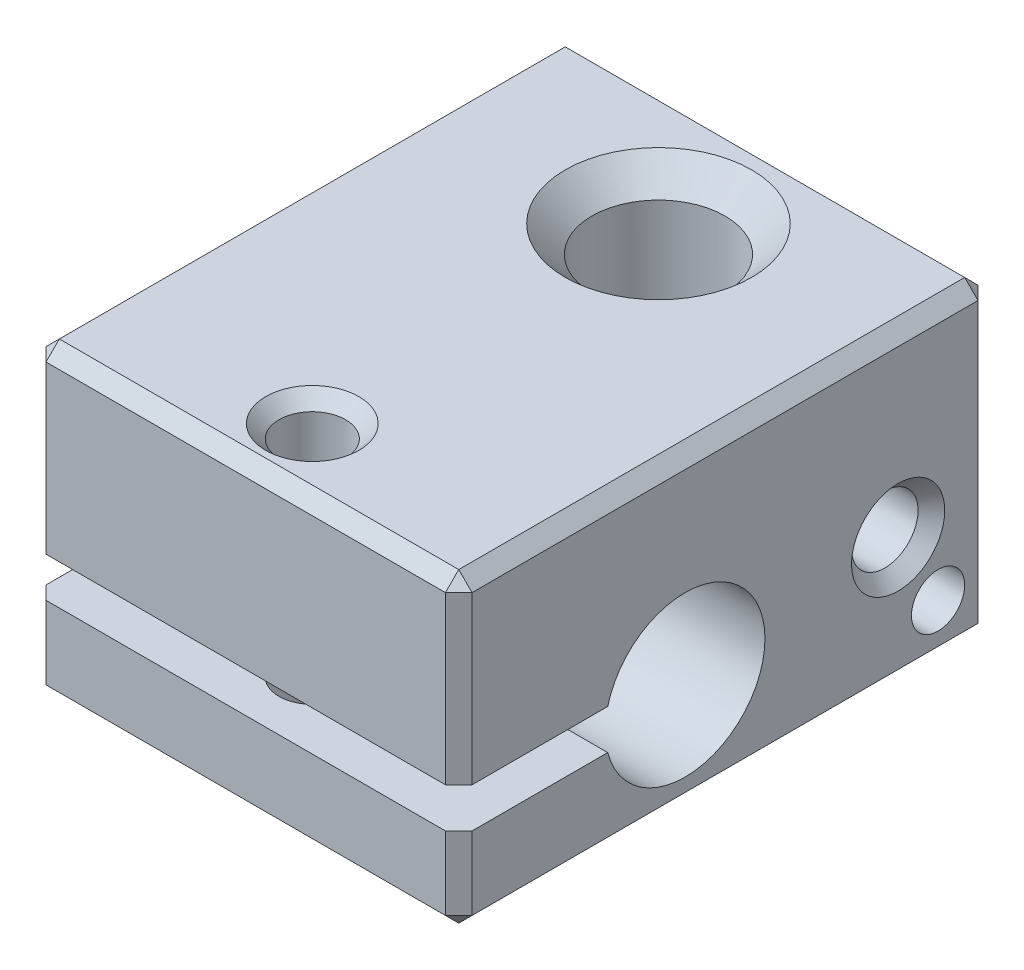
ISO-10303-21;
HEADER;
FILE_DESCRIPTION(('STEP AP214'),'2;1');
FILE_NAME('part.step','',(''),(''),'','','');
FILE_SCHEMA(('AUTOMOTIVE_DESIGN { 1 0 10303 214 1 1 1 1 }'));
ENDSEC;
DATA;
#1=APPLICATION_CONTEXT('core data for automotive mechanical design processes');
#2=APPLICATION_PROTOCOL_DEFINITION('international standard','automotive_design',2000,#1);
#3=PRODUCT_CONTEXT('',#1,'mechanical');
#4=PRODUCT('Part','Part','',(#3));
#5=PRODUCT_RELATED_PRODUCT_CATEGORY('part','',(#4));
#6=PRODUCT_DEFINITION_FORMATION('','',#4);
#7=PRODUCT_DEFINITION_CONTEXT('part definition',#1,'design');
#8=PRODUCT_DEFINITION('design','',#6,#7);
#9=PRODUCT_DEFINITION_SHAPE('','',#8);
#10=(LENGTH_UNIT() NAMED_UNIT(*) SI_UNIT(.MILLI.,.METRE.));
#11=(NAMED_UNIT(*) PLANE_ANGLE_UNIT() SI_UNIT($,.RADIAN.));
#12=(NAMED_UNIT(*) SI_UNIT($,.STERADIAN.) SOLID_ANGLE_UNIT());
#13=UNCERTAINTY_MEASURE_WITH_UNIT(LENGTH_MEASURE(1.E-05),#10,'distance_accuracy_value','');
#14=(GEOMETRIC_REPRESENTATION_CONTEXT(3) GLOBAL_UNCERTAINTY_ASSIGNED_CONTEXT((#13)) GLOBAL_UNIT_ASSIGNED_CONTEXT((#10,
#11,#12)) REPRESENTATION_CONTEXT('',''));
#15=CARTESIAN_POINT('',(0.,0.,0.));
#16=DIRECTION('',(0.,0.,1.));
#17=DIRECTION('',(1.,0.,0.));
#18=AXIS2_PLACEMENT_3D('',#15,#16,#17);
#19=CARTESIAN_POINT('',(8.,-5.75,10.));
#20=DIRECTION('',(0.,0.,-1.));
#21=DIRECTION('',(-1.,0.,0.));
#22=AXIS2_PLACEMENT_3D('',#19,#20,#21);
#23=PLANE('',#22);
#24=DIRECTION('',(-1.,0.,0.));
#25=VECTOR('',#24,1.);
#26=CARTESIAN_POINT('',(8.,5.25,10.));
#27=LINE('',#26,#25);
#28=CARTESIAN_POINT('',(7.5,5.25,10.));
#29=VERTEX_POINT('',#28);
#30=CARTESIAN_POINT('',(-7.5,5.25,10.));
#31=VERTEX_POINT('',#30);
#32=EDGE_CURVE('E53',#29,#31,#27,.T.);
#33=ORIENTED_EDGE('',*,*,#32,.T.);
#34=DIRECTION('',(0.,-1.,0.));
#35=VECTOR('',#34,1.);
#36=CARTESIAN_POINT('',(-7.5,-5.75,10.));
#37=LINE('',#36,#35);
#38=CARTESIAN_POINT('',(-7.5,-1.,10.));
#39=VERTEX_POINT('',#38);
#40=EDGE_CURVE('E308',#31,#39,#37,.T.);
#41=ORIENTED_EDGE('',*,*,#40,.T.);
#42=DIRECTION('',(1.,0.,0.));
#43=VECTOR('',#42,1.);
#44=CARTESIAN_POINT('',(-8.001,-1.,10.));
#45=LINE('',#44,#43);
#46=CARTESIAN_POINT('',(7.5,-1.,10.));
#47=VERTEX_POINT('',#46);
#48=EDGE_CURVE('E204',#39,#47,#45,.T.);
#49=ORIENTED_EDGE('',*,*,#48,.T.);
#50=DIRECTION('',(0.,1.,0.));
#51=VECTOR('',#50,1.);
#52=CARTESIAN_POINT('',(7.5,5.75,10.));
#53=LINE('',#52,#51);
#54=EDGE_CURVE('E58',#47,#29,#53,.T.);
#55=ORIENTED_EDGE('',*,*,#54,.T.);
#56=EDGE_LOOP('',(#33,#41,#49,#55));
#57=FACE_BOUND('',#56,.T.);
#58=ADVANCED_FACE('F36',(#57),#23,.F.);
#59=DIRECTION('',(1.,0.,0.));
#60=VECTOR('',#59,1.);
#61=CARTESIAN_POINT('',(-8.001,-2.5,10.));
#62=LINE('',#61,#60);
#63=CARTESIAN_POINT('',(-7.5,-2.5,10.));
#64=VERTEX_POINT('',#63);
#65=CARTESIAN_POINT('',(7.49999999999999,-2.5,10.));
#66=VERTEX_POINT('',#65);
#67=EDGE_CURVE('E203',#64,#66,#62,.T.);
#68=ORIENTED_EDGE('',*,*,#67,.F.);
#69=DIRECTION('',(0.,-1.,0.));
#70=VECTOR('',#69,1.);
#71=CARTESIAN_POINT('',(-7.5,-5.75,10.));
#72=LINE('',#71,#70);
#73=CARTESIAN_POINT('',(-7.5,-5.25,10.));
#74=VERTEX_POINT('',#73);
#75=EDGE_CURVE('E272',#64,#74,#72,.T.);
#76=ORIENTED_EDGE('',*,*,#75,.T.);
#77=DIRECTION('',(1.,0.,0.));
#78=VECTOR('',#77,1.);
#79=CARTESIAN_POINT('',(8.,-5.25,10.));
#80=LINE('',#79,#78);
#81=CARTESIAN_POINT('',(7.5,-5.25,10.));
#82=VERTEX_POINT('',#81);
#83=EDGE_CURVE('E270',#74,#82,#80,.T.);
#84=ORIENTED_EDGE('',*,*,#83,.T.);
#85=DIRECTION('',(0.,1.,0.));
#86=VECTOR('',#85,1.);
#87=CARTESIAN_POINT('',(7.5,-2.5,10.));
#88=LINE('',#87,#86);
#89=EDGE_CURVE('E268',#82,#66,#88,.T.);
#90=ORIENTED_EDGE('',*,*,#89,.T.);
#91=EDGE_LOOP('',(#68,#76,#84,#90));
#92=FACE_BOUND('',#91,.T.);
#93=ADVANCED_FACE('F399',(#92),#23,.F.);
#94=CARTESIAN_POINT('',(8.,-5.75,-9.99999999999999));
#95=DIRECTION('',(0.,1.,0.));
#96=DIRECTION('',(0.,0.,1.));
#97=AXIS2_PLACEMENT_3D('',#94,#95,#96);
#98=PLANE('',#97);
#99=DIRECTION('',(-1.,0.,0.));
#100=VECTOR('',#99,1.);
#101=CARTESIAN_POINT('',(8.,-5.75,9.50000000000002));
#102=LINE('',#101,#100);
#103=CARTESIAN_POINT('',(7.5,-5.75,9.50000000000002));
#104=VERTEX_POINT('',#103);
#105=CARTESIAN_POINT('',(-7.5,-5.75,9.50000000000002));
#106=VERTEX_POINT('',#105);
#107=EDGE_CURVE('E252',#104,#106,#102,.T.);
#108=ORIENTED_EDGE('',*,*,#107,.T.);
#109=DIRECTION('',(0.,0.,-1.));
#110=VECTOR('',#109,1.);
#111=CARTESIAN_POINT('',(-7.5,-5.75,-9.99999999999999));
#112=LINE('',#111,#110);
#113=CARTESIAN_POINT('',(-7.5,-5.75,-9.49999999999999));
#114=VERTEX_POINT('',#113);
#115=EDGE_CURVE('E254',#106,#114,#112,.T.);
#116=ORIENTED_EDGE('',*,*,#115,.T.);
#117=DIRECTION('',(1.,0.,0.));
#118=VECTOR('',#117,1.);
#119=CARTESIAN_POINT('',(8.,-5.75,-9.49999999999999));
#120=LINE('',#119,#118);
#121=CARTESIAN_POINT('',(7.5,-5.75,-9.49999999999999));
#122=VERTEX_POINT('',#121);
#123=EDGE_CURVE('E247',#114,#122,#120,.T.);
#124=ORIENTED_EDGE('',*,*,#123,.T.);
#125=DIRECTION('',(0.,0.,1.));
#126=VECTOR('',#125,1.);
#127=CARTESIAN_POINT('',(7.5,-5.75,10.));
#128=LINE('',#127,#126);
#129=EDGE_CURVE('E250',#122,#104,#128,.T.);
#130=ORIENTED_EDGE('',*,*,#129,.T.);
#131=EDGE_LOOP('',(#108,#116,#124,#130));
#132=FACE_BOUND('',#131,.T.);
#133=CARTESIAN_POINT('',(0.,-5.75,-5.5));
#134=DIRECTION('',(0.,1.,0.));
#135=DIRECTION('',(0.,0.,1.));
#136=AXIS2_PLACEMENT_3D('',#133,#134,#135);
#137=CIRCLE('',#136,3.5);
#138=CARTESIAN_POINT('',(0.,-5.75,-2.));
#139=VERTEX_POINT('',#138);
#140=EDGE_CURVE('E230',#139,#139,#137,.T.);
#141=ORIENTED_EDGE('',*,*,#140,.T.);
#142=EDGE_LOOP('',(#141));
#143=FACE_BOUND('',#142,.T.);
#144=CARTESIAN_POINT('',(0.,-5.75,7.50000000000001));
#145=DIRECTION('',(0.,1.,0.));
#146=DIRECTION('',(0.,0.,1.));
#147=AXIS2_PLACEMENT_3D('',#144,#145,#146);
#148=CIRCLE('',#147,1.74999999999999);
#149=CARTESIAN_POINT('',(0.,-5.75,9.25));
#150=VERTEX_POINT('',#149);
#151=EDGE_CURVE('E221',#150,#150,#148,.T.);
#152=ORIENTED_EDGE('',*,*,#151,.T.);
#153=EDGE_LOOP('',(#152));
#154=FACE_BOUND('',#153,.T.);
#155=ADVANCED_FACE('F404',(#132,#143,#154),#98,.F.);
#156=CARTESIAN_POINT('',(8.,-5.75,-9.99999999999999));
#157=DIRECTION('',(0.,0.,1.));
#158=DIRECTION('',(1.,0.,0.));
#159=AXIS2_PLACEMENT_3D('',#156,#157,#158);
#160=PLANE('',#159);
#161=DIRECTION('',(0.,-1.,0.));
#162=VECTOR('',#161,1.);
#163=CARTESIAN_POINT('',(7.5,-5.75,-9.99999999999999));
#164=LINE('',#163,#162);
#165=CARTESIAN_POINT('',(7.5,5.25,-9.99999999999999));
#166=VERTEX_POINT('',#165);
#167=CARTESIAN_POINT('',(7.5,-5.25,-9.99999999999999));
#168=VERTEX_POINT('',#167);
#169=EDGE_CURVE('E292',#166,#168,#164,.T.);
#170=ORIENTED_EDGE('',*,*,#169,.T.);
#171=DIRECTION('',(-1.,0.,0.));
#172=VECTOR('',#171,1.);
#173=CARTESIAN_POINT('',(8.,-5.25,-9.99999999999999));
#174=LINE('',#173,#172);
#175=CARTESIAN_POINT('',(-7.5,-5.25,-9.99999999999999));
#176=VERTEX_POINT('',#175);
#177=EDGE_CURVE('E294',#168,#176,#174,.T.);
#178=ORIENTED_EDGE('',*,*,#177,.T.);
#179=DIRECTION('',(0.,1.,0.));
#180=VECTOR('',#179,1.);
#181=CARTESIAN_POINT('',(-7.5,-5.75,-9.99999999999999));
#182=LINE('',#181,#180);
#183=CARTESIAN_POINT('',(-7.5,5.25,-9.99999999999999));
#184=VERTEX_POINT('',#183);
#185=EDGE_CURVE('E290',#176,#184,#182,.T.);
#186=ORIENTED_EDGE('',*,*,#185,.T.);
#187=DIRECTION('',(1.,0.,0.));
#188=VECTOR('',#187,1.);
#189=CARTESIAN_POINT('',(8.,5.25,-9.99999999999999));
#190=LINE('',#189,#188);
#191=EDGE_CURVE('E288',#184,#166,#190,.T.);
#192=ORIENTED_EDGE('',*,*,#191,.T.);
#193=EDGE_LOOP('',(#170,#178,#186,#192));
#194=FACE_BOUND('',#193,.T.);
#195=ADVANCED_FACE('F543',(#194),#160,.F.);
#196=CARTESIAN_POINT('',(8.,5.75,-9.99999999999999));
#197=DIRECTION('',(0.,-1.,0.));
#198=DIRECTION('',(0.,0.,-1.));
#199=AXIS2_PLACEMENT_3D('',#196,#197,#198);
#200=PLANE('',#199);
#201=DIRECTION('',(0.,0.,-1.));
#202=VECTOR('',#201,1.);
#203=CARTESIAN_POINT('',(7.5,5.75,-9.99999999999999));
#204=LINE('',#203,#202);
#205=CARTESIAN_POINT('',(7.5,5.75,9.50000000000002));
#206=VERTEX_POINT('',#205);
#207=CARTESIAN_POINT('',(7.5,5.75,-9.49999999999999));
#208=VERTEX_POINT('',#207);
#209=EDGE_CURVE('E297',#206,#208,#204,.T.);
#210=ORIENTED_EDGE('',*,*,#209,.T.);
#211=DIRECTION('',(-1.,0.,0.));
#212=VECTOR('',#211,1.);
#213=CARTESIAN_POINT('',(8.,5.75,-9.49999999999999));
#214=LINE('',#213,#212);
#215=CARTESIAN_POINT('',(-7.5,5.75,-9.49999999999999));
#216=VERTEX_POINT('',#215);
#217=EDGE_CURVE('E303',#208,#216,#214,.T.);
#218=ORIENTED_EDGE('',*,*,#217,.T.);
#219=DIRECTION('',(0.,0.,1.));
#220=VECTOR('',#219,1.);
#221=CARTESIAN_POINT('',(-7.5,5.75,-9.99999999999999));
#222=LINE('',#221,#220);
#223=CARTESIAN_POINT('',(-7.5,5.75,9.50000000000002));
#224=VERTEX_POINT('',#223);
#225=EDGE_CURVE('E301',#216,#224,#222,.T.);
#226=ORIENTED_EDGE('',*,*,#225,.T.);
#227=DIRECTION('',(1.,0.,0.));
#228=VECTOR('',#227,1.);
#229=CARTESIAN_POINT('',(8.,5.75,9.50000000000002));
#230=LINE('',#229,#228);
#231=EDGE_CURVE('E299',#224,#206,#230,.T.);
#232=ORIENTED_EDGE('',*,*,#231,.T.);
#233=EDGE_LOOP('',(#210,#218,#226,#232));
#234=FACE_BOUND('',#233,.T.);
#235=CARTESIAN_POINT('',(0.,5.75,-5.49999999999999));
#236=DIRECTION('',(0.,-1.,0.));
#237=DIRECTION('',(0.,0.,-1.));
#238=AXIS2_PLACEMENT_3D('',#235,#236,#237);
#239=CIRCLE('',#238,3.49999999999999);
#240=CARTESIAN_POINT('',(0.,5.75,-8.99999999999998));
#241=VERTEX_POINT('',#240);
#242=EDGE_CURVE('E239',#241,#241,#239,.T.);
#243=ORIENTED_EDGE('',*,*,#242,.T.);
#244=EDGE_LOOP('',(#243));
#245=FACE_BOUND('',#244,.T.);
#246=CARTESIAN_POINT('',(0.,5.75,7.50000000000001));
#247=DIRECTION('',(0.,-1.,0.));
#248=DIRECTION('',(0.,0.,-1.));
#249=AXIS2_PLACEMENT_3D('',#246,#247,#248);
#250=CIRCLE('',#249,1.74999999999998);
#251=CARTESIAN_POINT('',(0.,5.75,5.75000000000003));
#252=VERTEX_POINT('',#251);
#253=EDGE_CURVE('E227',#252,#252,#250,.T.);
#254=ORIENTED_EDGE('',*,*,#253,.T.);
#255=EDGE_LOOP('',(#254));
#256=FACE_BOUND('',#255,.T.);
#257=ADVANCED_FACE('F550',(#234,#245,#256),#200,.F.);
#258=CARTESIAN_POINT('',(8.,5.75,10.));
#259=DIRECTION('',(1.,0.,0.));
#260=DIRECTION('',(0.,0.,-1.));
#261=AXIS2_PLACEMENT_3D('',#258,#259,#260);
#262=PLANE('',#261);
#263=CARTESIAN_POINT('',(8.,-3.75,-7.99999999999999));
#264=DIRECTION('',(1.,0.,0.));
#265=DIRECTION('',(0.,0.,-1.));
#266=AXIS2_PLACEMENT_3D('',#263,#264,#265);
#267=CIRCLE('',#266,1.);
#268=CARTESIAN_POINT('',(8.,-3.75,-8.99999999999999));
#269=VERTEX_POINT('',#268);
#270=EDGE_CURVE('E379',#269,#269,#267,.T.);
#271=ORIENTED_EDGE('',*,*,#270,.F.);
#272=EDGE_LOOP('',(#271));
#273=FACE_BOUND('',#272,.T.);
#274=CARTESIAN_POINT('',(8.,-0.950000000000001,-6.5));
#275=DIRECTION('',(1.,0.,0.));
#276=DIRECTION('',(0.,0.,-1.));
#277=AXIS2_PLACEMENT_3D('',#274,#275,#276);
#278=CIRCLE('',#277,1.75);
#279=CARTESIAN_POINT('',(8.,-0.950000000000001,-8.25));
#280=VERTEX_POINT('',#279);
#281=EDGE_CURVE('E245',#280,#280,#278,.F.);
#282=ORIENTED_EDGE('',*,*,#281,.T.);
#283=EDGE_LOOP('',(#282));
#284=FACE_BOUND('',#283,.T.);
#285=DIRECTION('',(0.,0.,-1.));
#286=VECTOR('',#285,1.);
#287=CARTESIAN_POINT('',(8.,-2.5,10.));
#288=LINE('',#287,#286);
#289=CARTESIAN_POINT('',(8.,-2.5,9.50000000000002));
#290=VERTEX_POINT('',#289);
#291=CARTESIAN_POINT('',(8.,-2.5,4.40473750965557));
#292=VERTEX_POINT('',#291);
#293=EDGE_CURVE('E195',#290,#292,#288,.T.);
#294=ORIENTED_EDGE('',*,*,#293,.F.);
#295=DIRECTION('',(0.,-1.,0.));
#296=VECTOR('',#295,1.);
#297=CARTESIAN_POINT('',(8.,-5.75,9.50000000000002));
#298=LINE('',#297,#296);
#299=CARTESIAN_POINT('',(8.,-5.25,9.50000000000002));
#300=VERTEX_POINT('',#299);
#301=EDGE_CURVE('E286',#290,#300,#298,.T.);
#302=ORIENTED_EDGE('',*,*,#301,.T.);
#303=DIRECTION('',(0.,0.,-1.));
#304=VECTOR('',#303,1.);
#305=CARTESIAN_POINT('',(8.,-5.25,-9.99999999999999));
#306=LINE('',#305,#304);
#307=CARTESIAN_POINT('',(8.,-5.25,-9.49999999999999));
#308=VERTEX_POINT('',#307);
#309=EDGE_CURVE('E284',#300,#308,#306,.T.);
#310=ORIENTED_EDGE('',*,*,#309,.T.);
#311=DIRECTION('',(0.,1.,0.));
#312=VECTOR('',#311,1.);
#313=CARTESIAN_POINT('',(8.,5.75,-9.49999999999999));
#314=LINE('',#313,#312);
#315=CARTESIAN_POINT('',(8.,5.25,-9.49999999999999));
#316=VERTEX_POINT('',#315);
#317=EDGE_CURVE('E282',#308,#316,#314,.T.);
#318=ORIENTED_EDGE('',*,*,#317,.T.);
#319=DIRECTION('',(0.,0.,1.));
#320=VECTOR('',#319,1.);
#321=CARTESIAN_POINT('',(8.,5.25,10.));
#322=LINE('',#321,#320);
#323=CARTESIAN_POINT('',(8.,5.25,9.50000000000002));
#324=VERTEX_POINT('',#323);
#325=EDGE_CURVE('E280',#316,#324,#322,.T.);
#326=ORIENTED_EDGE('',*,*,#325,.T.);
#327=DIRECTION('',(0.,-1.,0.));
#328=VECTOR('',#327,1.);
#329=CARTESIAN_POINT('',(8.,-1.,9.50000000000002));
#330=LINE('',#329,#328);
#331=CARTESIAN_POINT('',(8.,-1.,9.50000000000002));
#332=VERTEX_POINT('',#331);
#333=EDGE_CURVE('E278',#324,#332,#330,.T.);
#334=ORIENTED_EDGE('',*,*,#333,.T.);
#335=DIRECTION('',(0.,0.,1.));
#336=VECTOR('',#335,1.);
#337=CARTESIAN_POINT('',(8.,-1.,10.));
#338=LINE('',#337,#336);
#339=CARTESIAN_POINT('',(8.,-1.,4.40473750965557));
#340=VERTEX_POINT('',#339);
#341=EDGE_CURVE('E200',#340,#332,#338,.T.);
#342=ORIENTED_EDGE('',*,*,#341,.F.);
#343=CARTESIAN_POINT('',(8.,-1.75,1.5));
#344=DIRECTION('',(1.,0.,0.));
#345=DIRECTION('',(0.,0.,-1.));
#346=AXIS2_PLACEMENT_3D('',#343,#344,#345);
#347=CIRCLE('',#346,3.);
#348=EDGE_CURVE('E197',#292,#340,#347,.T.);
#349=ORIENTED_EDGE('',*,*,#348,.F.);
#350=EDGE_LOOP('',(#294,#302,#310,#318,#326,#334,#342,#349));
#351=FACE_BOUND('',#350,.T.);
#352=ADVANCED_FACE('F531',(#273,#284,#351),#262,.T.);
#353=CARTESIAN_POINT('',(-8.,5.75,10.));
#354=DIRECTION('',(1.,0.,0.));
#355=DIRECTION('',(0.,0.,-1.));
#356=AXIS2_PLACEMENT_3D('',#353,#354,#355);
#357=PLANE('',#356);
#358=DIRECTION('',(0.,0.,1.));
#359=VECTOR('',#358,1.);
#360=CARTESIAN_POINT('',(-8.,-5.25,10.));
#361=LINE('',#360,#359);
#362=CARTESIAN_POINT('',(-8.,-5.25,-9.49999999999999));
#363=VERTEX_POINT('',#362);
#364=CARTESIAN_POINT('',(-8.,-5.25,9.50000000000002));
#365=VERTEX_POINT('',#364);
#366=EDGE_CURVE('E263',#363,#365,#361,.T.);
#367=ORIENTED_EDGE('',*,*,#366,.T.);
#368=DIRECTION('',(0.,1.,0.));
#369=VECTOR('',#368,1.);
#370=CARTESIAN_POINT('',(-8.,5.75,9.50000000000002));
#371=LINE('',#370,#369);
#372=CARTESIAN_POINT('',(-8.,-2.5,9.50000000000002));
#373=VERTEX_POINT('',#372);
#374=EDGE_CURVE('E266',#365,#373,#371,.T.);
#375=ORIENTED_EDGE('',*,*,#374,.T.);
#376=DIRECTION('',(0.,0.,1.));
#377=VECTOR('',#376,1.);
#378=CARTESIAN_POINT('',(-8.,-2.5,10.));
#379=LINE('',#378,#377);
#380=CARTESIAN_POINT('',(-8.,-2.5,4.40473750965557));
#381=VERTEX_POINT('',#380);
#382=EDGE_CURVE('E206',#381,#373,#379,.T.);
#383=ORIENTED_EDGE('',*,*,#382,.F.);
#384=CARTESIAN_POINT('',(-8.,-1.75,1.5));
#385=DIRECTION('',(1.,0.,0.));
#386=DIRECTION('',(0.,0.,-1.));
#387=AXIS2_PLACEMENT_3D('',#384,#385,#386);
#388=CIRCLE('',#387,3.);
#389=CARTESIAN_POINT('',(-8.,-1.,4.40473750965557));
#390=VERTEX_POINT('',#389);
#391=EDGE_CURVE('E191',#390,#381,#388,.F.);
#392=ORIENTED_EDGE('',*,*,#391,.F.);
#393=DIRECTION('',(0.,0.,-1.));
#394=VECTOR('',#393,1.);
#395=CARTESIAN_POINT('',(-8.,-1.,10.));
#396=LINE('',#395,#394);
#397=CARTESIAN_POINT('',(-8.,-1.,9.50000000000002));
#398=VERTEX_POINT('',#397);
#399=EDGE_CURVE('E193',#398,#390,#396,.T.);
#400=ORIENTED_EDGE('',*,*,#399,.F.);
#401=DIRECTION('',(0.,1.,0.));
#402=VECTOR('',#401,1.);
#403=CARTESIAN_POINT('',(-8.,5.75,9.50000000000002));
#404=LINE('',#403,#402);
#405=CARTESIAN_POINT('',(-8.,5.25,9.50000000000002));
#406=VERTEX_POINT('',#405);
#407=EDGE_CURVE('E257',#398,#406,#404,.T.);
#408=ORIENTED_EDGE('',*,*,#407,.T.);
#409=DIRECTION('',(0.,0.,-1.));
#410=VECTOR('',#409,1.);
#411=CARTESIAN_POINT('',(-8.,5.25,10.));
#412=LINE('',#411,#410);
#413=CARTESIAN_POINT('',(-8.,5.25,-9.49999999999999));
#414=VERTEX_POINT('',#413);
#415=EDGE_CURVE('E259',#406,#414,#412,.T.);
#416=ORIENTED_EDGE('',*,*,#415,.T.);
#417=DIRECTION('',(0.,-1.,0.));
#418=VECTOR('',#417,1.);
#419=CARTESIAN_POINT('',(-8.,5.75,-9.49999999999999));
#420=LINE('',#419,#418);
#421=EDGE_CURVE('E261',#414,#363,#420,.T.);
#422=ORIENTED_EDGE('',*,*,#421,.T.);
#423=EDGE_LOOP('',(#367,#375,#383,#392,#400,#408,#416,#422));
#424=FACE_BOUND('',#423,.T.);
#425=ADVANCED_FACE('F555',(#424),#357,.F.);
#426=CARTESIAN_POINT('',(-8.001,-1.,10.));
#427=DIRECTION('',(0.,1.,0.));
#428=DIRECTION('',(0.,0.,1.));
#429=AXIS2_PLACEMENT_3D('',#426,#427,#428);
#430=PLANE('',#429);
#431=CARTESIAN_POINT('',(0.,-1.,7.50000000000001));
#432=DIRECTION('',(0.,1.,0.));
#433=DIRECTION('',(0.,0.,1.));
#434=AXIS2_PLACEMENT_3D('',#431,#432,#433);
#435=CIRCLE('',#434,1.24999999999999);
#436=CARTESIAN_POINT('',(0.,-1.,8.75));
#437=VERTEX_POINT('',#436);
#438=EDGE_CURVE('E180',#437,#437,#435,.T.);
#439=ORIENTED_EDGE('',*,*,#438,.T.);
#440=EDGE_LOOP('',(#439));
#441=FACE_BOUND('',#440,.T.);
#442=ORIENTED_EDGE('',*,*,#48,.F.);
#443=DIRECTION('',(0.707106781186548,0.,0.707106781186548));
#444=VECTOR('',#443,1.);
#445=CARTESIAN_POINT('',(-7.5,-1.,10.));
#446=LINE('',#445,#444);
#447=EDGE_CURVE('E11',#39,#398,#446,.F.);
#448=ORIENTED_EDGE('',*,*,#447,.T.);
#449=ORIENTED_EDGE('',*,*,#399,.T.);
#450=DIRECTION('',(1.,0.,0.));
#451=VECTOR('',#450,1.);
#452=CARTESIAN_POINT('',(-8.001,-1.,4.40473750965557));
#453=LINE('',#452,#451);
#454=EDGE_CURVE('E207',#390,#340,#453,.T.);
#455=ORIENTED_EDGE('',*,*,#454,.T.);
#456=ORIENTED_EDGE('',*,*,#341,.T.);
#457=DIRECTION('',(-0.707106781186548,0.,0.707106781186548));
#458=VECTOR('',#457,1.);
#459=CARTESIAN_POINT('',(8.,-1.,9.50000000000002));
#460=LINE('',#459,#458);
#461=EDGE_CURVE('E45',#332,#47,#460,.T.);
#462=ORIENTED_EDGE('',*,*,#461,.T.);
#463=EDGE_LOOP('',(#442,#448,#449,#455,#456,#462));
#464=FACE_BOUND('',#463,.T.);
#465=ADVANCED_FACE('F524',(#441,#464),#430,.F.);
#466=CARTESIAN_POINT('',(-8.001,-1.75,1.5));
#467=DIRECTION('',(1.,0.,0.));
#468=DIRECTION('',(0.,0.,-1.));
#469=AXIS2_PLACEMENT_3D('',#466,#467,#468);
#470=CYLINDRICAL_SURFACE('',#469,3.);
#471=ORIENTED_EDGE('',*,*,#391,.T.);
#472=DIRECTION('',(1.,0.,0.));
#473=VECTOR('',#472,1.);
#474=CARTESIAN_POINT('',(-8.001,-2.5,4.40473750965557));
#475=LINE('',#474,#473);
#476=EDGE_CURVE('E209',#381,#292,#475,.T.);
#477=ORIENTED_EDGE('',*,*,#476,.T.);
#478=ORIENTED_EDGE('',*,*,#348,.T.);
#479=ORIENTED_EDGE('',*,*,#454,.F.);
#480=EDGE_LOOP('',(#471,#477,#478,#479));
#481=FACE_BOUND('',#480,.T.);
#482=ADVANCED_FACE('F562',(#481),#470,.F.);
#483=CARTESIAN_POINT('',(-8.001,-2.5,10.));
#484=DIRECTION('',(0.,-1.,0.));
#485=DIRECTION('',(0.,0.,-1.));
#486=AXIS2_PLACEMENT_3D('',#483,#484,#485);
#487=PLANE('',#486);
#488=CARTESIAN_POINT('',(0.,-2.5,7.50000000000001));
#489=DIRECTION('',(0.,-1.,0.));
#490=DIRECTION('',(0.,0.,-1.));
#491=AXIS2_PLACEMENT_3D('',#488,#489,#490);
#492=CIRCLE('',#491,1.24999999999999);
#493=CARTESIAN_POINT('',(0.,-2.5,6.25000000000001));
#494=VERTEX_POINT('',#493);
#495=EDGE_CURVE('E188',#494,#494,#492,.T.);
#496=ORIENTED_EDGE('',*,*,#495,.T.);
#497=EDGE_LOOP('',(#496));
#498=FACE_BOUND('',#497,.T.);
#499=ORIENTED_EDGE('',*,*,#382,.T.);
#500=DIRECTION('',(-0.707106781186548,0.,-0.707106781186548));
#501=VECTOR('',#500,1.);
#502=CARTESIAN_POINT('',(-7.5,-2.5,10.));
#503=LINE('',#502,#501);
#504=EDGE_CURVE('E276',#373,#64,#503,.F.);
#505=ORIENTED_EDGE('',*,*,#504,.T.);
#506=ORIENTED_EDGE('',*,*,#67,.T.);
#507=DIRECTION('',(0.707106781186548,0.,-0.707106781186548));
#508=VECTOR('',#507,1.);
#509=CARTESIAN_POINT('',(8.,-2.5,9.50000000000002));
#510=LINE('',#509,#508);
#511=EDGE_CURVE('E274',#66,#290,#510,.T.);
#512=ORIENTED_EDGE('',*,*,#511,.T.);
#513=ORIENTED_EDGE('',*,*,#293,.T.);
#514=ORIENTED_EDGE('',*,*,#476,.F.);
#515=EDGE_LOOP('',(#499,#505,#506,#512,#513,#514));
#516=FACE_BOUND('',#515,.T.);
#517=ADVANCED_FACE('F583',(#498,#516),#487,.F.);
#518=CARTESIAN_POINT('',(0.,5.75,7.50000000000001));
#519=DIRECTION('',(0.,1.,0.));
#520=DIRECTION('',(0.,0.,1.));
#521=AXIS2_PLACEMENT_3D('',#518,#519,#520);
#522=CYLINDRICAL_SURFACE('',#521,1.24999999999999);
#523=CARTESIAN_POINT('',(0.,5.25000000000002,7.50000000000001));
#524=DIRECTION('',(0.,-1.,0.));
#525=DIRECTION('',(0.,0.,-1.));
#526=AXIS2_PLACEMENT_3D('',#523,#524,#525);
#527=CIRCLE('',#526,1.24999999999999);
#528=CARTESIAN_POINT('',(0.,5.25000000000002,6.25000000000001));
#529=VERTEX_POINT('',#528);
#530=EDGE_CURVE('E224',#529,#529,#527,.F.);
#531=ORIENTED_EDGE('',*,*,#530,.T.);
#532=EDGE_LOOP('',(#531));
#533=FACE_BOUND('',#532,.T.);
#534=ORIENTED_EDGE('',*,*,#438,.F.);
#535=EDGE_LOOP('',(#534));
#536=FACE_BOUND('',#535,.T.);
#537=ADVANCED_FACE('F600',(#533,#536),#522,.F.);
#538=CARTESIAN_POINT('',(0.,-5.25,7.50000000000001));
#539=DIRECTION('',(0.,1.,0.));
#540=DIRECTION('',(0.,0.,1.));
#541=AXIS2_PLACEMENT_3D('',#538,#539,#540);
#542=CIRCLE('',#541,1.24999999999999);
#543=CARTESIAN_POINT('',(0.,-5.25,8.75));
#544=VERTEX_POINT('',#543);
#545=EDGE_CURVE('E216',#544,#544,#542,.F.);
#546=ORIENTED_EDGE('',*,*,#545,.T.);
#547=EDGE_LOOP('',(#546));
#548=FACE_BOUND('',#547,.T.);
#549=ORIENTED_EDGE('',*,*,#495,.F.);
#550=EDGE_LOOP('',(#549));
#551=FACE_BOUND('',#550,.T.);
#552=ADVANCED_FACE('F597',(#548,#551),#522,.F.);
#553=CARTESIAN_POINT('',(0.,5.75,-5.49999999999999));
#554=DIRECTION('',(0.,1.,0.));
#555=DIRECTION('',(0.,0.,1.));
#556=AXIS2_PLACEMENT_3D('',#553,#554,#555);
#557=CYLINDRICAL_SURFACE('',#556,2.49999999999999);
#558=CARTESIAN_POINT('',(0.,-4.74999999999999,-5.5));
#559=DIRECTION('',(0.,1.,0.));
#560=DIRECTION('',(0.,0.,1.));
#561=AXIS2_PLACEMENT_3D('',#558,#559,#560);
#562=CIRCLE('',#561,2.49999999999999);
#563=CARTESIAN_POINT('',(0.,-4.74999999999999,-3.));
#564=VERTEX_POINT('',#563);
#565=EDGE_CURVE('E236',#564,#564,#562,.F.);
#566=ORIENTED_EDGE('',*,*,#565,.T.);
#567=EDGE_LOOP('',(#566));
#568=FACE_BOUND('',#567,.T.);
#569=CARTESIAN_POINT('',(0.,4.75000000000001,-5.49999999999999));
#570=DIRECTION('',(0.,-1.,0.));
#571=DIRECTION('',(0.,0.,-1.));
#572=AXIS2_PLACEMENT_3D('',#569,#570,#571);
#573=CIRCLE('',#572,2.49999999999999);
#574=CARTESIAN_POINT('',(0.,4.75000000000001,-7.99999999999999));
#575=VERTEX_POINT('',#574);
#576=EDGE_CURVE('E233',#575,#575,#573,.F.);
#577=ORIENTED_EDGE('',*,*,#576,.T.);
#578=EDGE_LOOP('',(#577));
#579=FACE_BOUND('',#578,.T.);
#580=ADVANCED_FACE('F413',(#568,#579),#557,.F.);
#581=CARTESIAN_POINT('',(0.,-5.25,7.50000000000001));
#582=DIRECTION('',(0.,-1.,0.));
#583=DIRECTION('',(0.,0.,-1.));
#584=AXIS2_PLACEMENT_3D('',#581,#582,#583);
#585=CONICAL_SURFACE('',#584,1.24999999999999,0.785398163397447);
#586=ORIENTED_EDGE('',*,*,#151,.F.);
#587=EDGE_LOOP('',(#586));
#588=FACE_BOUND('',#587,.T.);
#589=ORIENTED_EDGE('',*,*,#545,.F.);
#590=EDGE_LOOP('',(#589));
#591=FACE_BOUND('',#590,.T.);
#592=ADVANCED_FACE('F409',(#588,#591),#585,.F.);
#593=CARTESIAN_POINT('',(0.,5.25000000000002,7.50000000000001));
#594=DIRECTION('',(0.,1.,0.));
#595=DIRECTION('',(0.,0.,1.));
#596=AXIS2_PLACEMENT_3D('',#593,#594,#595);
#597=CONICAL_SURFACE('',#596,1.24999999999999,0.785398163397452);
#598=ORIENTED_EDGE('',*,*,#253,.F.);
#599=EDGE_LOOP('',(#598));
#600=FACE_BOUND('',#599,.T.);
#601=ORIENTED_EDGE('',*,*,#530,.F.);
#602=EDGE_LOOP('',(#601));
#603=FACE_BOUND('',#602,.T.);
#604=ADVANCED_FACE('F412',(#600,#603),#597,.F.);
#605=CARTESIAN_POINT('',(0.,-5.75,-5.5));
#606=DIRECTION('',(0.,-1.,0.));
#607=DIRECTION('',(0.,0.,-1.));
#608=AXIS2_PLACEMENT_3D('',#605,#606,#607);
#609=CONICAL_SURFACE('',#608,3.5,0.785398163397447);
#610=ORIENTED_EDGE('',*,*,#565,.F.);
#611=EDGE_LOOP('',(#610));
#612=FACE_BOUND('',#611,.T.);
#613=ORIENTED_EDGE('',*,*,#140,.F.);
#614=EDGE_LOOP('',(#613));
#615=FACE_BOUND('',#614,.T.);
#616=ADVANCED_FACE('F417',(#612,#615),#609,.F.);
#617=CARTESIAN_POINT('',(0.,4.75000000000001,-5.49999999999999));
#618=DIRECTION('',(0.,1.,0.));
#619=DIRECTION('',(0.,0.,1.));
#620=AXIS2_PLACEMENT_3D('',#617,#618,#619);
#621=CONICAL_SURFACE('',#620,2.49999999999999,0.785398163397451);
#622=ORIENTED_EDGE('',*,*,#242,.F.);
#623=EDGE_LOOP('',(#622));
#624=FACE_BOUND('',#623,.T.);
#625=ORIENTED_EDGE('',*,*,#576,.F.);
#626=EDGE_LOOP('',(#625));
#627=FACE_BOUND('',#626,.T.);
#628=ADVANCED_FACE('F421',(#624,#627),#621,.F.);
#629=CARTESIAN_POINT('',(4.2,-0.950000000000001,-6.5));
#630=DIRECTION('',(1.,0.,0.));
#631=DIRECTION('',(0.,0.,-1.));
#632=AXIS2_PLACEMENT_3D('',#629,#630,#631);
#633=CONICAL_SURFACE('',#632,1.25,1.02974425867665);
#634=CARTESIAN_POINT('',(3.44892422621555,-0.950000000000002,-6.5));
#635=VERTEX_POINT('',#634);
#636=VERTEX_LOOP('',#635);
#637=FACE_BOUND('',#636,.T.);
#638=CARTESIAN_POINT('',(4.2,-0.950000000000001,-6.5));
#639=DIRECTION('',(1.,0.,0.));
#640=DIRECTION('',(0.,0.,-1.));
#641=AXIS2_PLACEMENT_3D('',#638,#639,#640);
#642=CIRCLE('',#641,1.25);
#643=CARTESIAN_POINT('',(4.2,-0.950000000000001,-7.74999999999999));
#644=VERTEX_POINT('',#643);
#645=EDGE_CURVE('E176',#644,#644,#642,.T.);
#646=ORIENTED_EDGE('',*,*,#645,.T.);
#647=EDGE_LOOP('',(#646));
#648=FACE_BOUND('',#647,.T.);
#649=ADVANCED_FACE('F425',(#637,#648),#633,.F.);
#650=CARTESIAN_POINT('',(8.,-0.950000000000001,-6.5));
#651=DIRECTION('',(1.,0.,0.));
#652=DIRECTION('',(0.,0.,-1.));
#653=AXIS2_PLACEMENT_3D('',#650,#651,#652);
#654=CYLINDRICAL_SURFACE('',#653,1.25);
#655=CARTESIAN_POINT('',(7.5,-0.950000000000001,-6.5));
#656=DIRECTION('',(1.,0.,0.));
#657=DIRECTION('',(0.,0.,-1.));
#658=AXIS2_PLACEMENT_3D('',#655,#656,#657);
#659=CIRCLE('',#658,1.25);
#660=CARTESIAN_POINT('',(7.5,-0.950000000000001,-7.74999999999999));
#661=VERTEX_POINT('',#660);
#662=EDGE_CURVE('E242',#661,#661,#659,.T.);
#663=ORIENTED_EDGE('',*,*,#662,.T.);
#664=EDGE_LOOP('',(#663));
#665=FACE_BOUND('',#664,.T.);
#666=ORIENTED_EDGE('',*,*,#645,.F.);
#667=EDGE_LOOP('',(#666));
#668=FACE_BOUND('',#667,.T.);
#669=ADVANCED_FACE('F429',(#665,#668),#654,.F.);
#670=CARTESIAN_POINT('',(7.5,-0.950000000000001,-6.5));
#671=DIRECTION('',(1.,0.,0.));
#672=DIRECTION('',(0.,0.,-1.));
#673=AXIS2_PLACEMENT_3D('',#670,#671,#672);
#674=CONICAL_SURFACE('',#673,1.25,0.785398163397451);
#675=ORIENTED_EDGE('',*,*,#281,.F.);
#676=EDGE_LOOP('',(#675));
#677=FACE_BOUND('',#676,.T.);
#678=ORIENTED_EDGE('',*,*,#662,.F.);
#679=EDGE_LOOP('',(#678));
#680=FACE_BOUND('',#679,.T.);
#681=ADVANCED_FACE('F396',(#677,#680),#674,.F.);
#682=CARTESIAN_POINT('',(6.,-3.75,-7.99999999999999));
#683=DIRECTION('',(1.,0.,0.));
#684=DIRECTION('',(0.,0.,-1.));
#685=AXIS2_PLACEMENT_3D('',#682,#683,#684);
#686=CONICAL_SURFACE('',#685,1.,1.02974425867666);
#687=CARTESIAN_POINT('',(6.,-3.75,-7.99999999999999));
#688=DIRECTION('',(1.,0.,0.));
#689=DIRECTION('',(0.,0.,-1.));
#690=AXIS2_PLACEMENT_3D('',#687,#688,#689);
#691=CIRCLE('',#690,1.);
#692=CARTESIAN_POINT('',(6.,-3.75,-8.99999999999999));
#693=VERTEX_POINT('',#692);
#694=EDGE_CURVE('E183',#693,#693,#691,.T.);
#695=ORIENTED_EDGE('',*,*,#694,.T.);
#696=EDGE_LOOP('',(#695));
#697=FACE_BOUND('',#696,.T.);
#698=CARTESIAN_POINT('',(5.84978484524311,-3.75,-7.99999999999999));
#699=DIRECTION('',(1.,0.,0.));
#700=DIRECTION('',(0.,0.,-1.));
#701=AXIS2_PLACEMENT_3D('',#698,#699,#700);
#702=CIRCLE('',#701,0.75);
#703=CARTESIAN_POINT('',(5.84978484524311,-3.75,-8.74999999999999));
#704=VERTEX_POINT('',#703);
#705=EDGE_CURVE('E177',#704,#704,#702,.T.);
#706=ORIENTED_EDGE('',*,*,#705,.F.);
#707=EDGE_LOOP('',(#706));
#708=FACE_BOUND('',#707,.T.);
#709=ADVANCED_FACE('F388',(#697,#708),#686,.F.);
#710=CARTESIAN_POINT('',(8.,-3.75,-7.99999999999999));
#711=DIRECTION('',(1.,0.,0.));
#712=DIRECTION('',(0.,0.,-1.));
#713=AXIS2_PLACEMENT_3D('',#710,#711,#712);
#714=CYLINDRICAL_SURFACE('',#713,1.);
#715=ORIENTED_EDGE('',*,*,#694,.F.);
#716=EDGE_LOOP('',(#715));
#717=FACE_BOUND('',#716,.T.);
#718=ORIENTED_EDGE('',*,*,#270,.T.);
#719=EDGE_LOOP('',(#718));
#720=FACE_BOUND('',#719,.T.);
#721=ADVANCED_FACE('F170',(#717,#720),#714,.F.);
#722=CARTESIAN_POINT('',(3.6,-3.75,-7.99999999999999));
#723=DIRECTION('',(1.,0.,0.));
#724=DIRECTION('',(0.,0.,-1.));
#725=AXIS2_PLACEMENT_3D('',#722,#723,#724);
#726=CONICAL_SURFACE('',#725,0.749999999999999,1.02974425867666);
#727=CARTESIAN_POINT('',(3.14935453572933,-3.75,-7.99999999999999));
#728=VERTEX_POINT('',#727);
#729=VERTEX_LOOP('',#728);
#730=FACE_BOUND('',#729,.T.);
#731=CARTESIAN_POINT('',(3.6,-3.75,-7.99999999999999));
#732=DIRECTION('',(1.,0.,0.));
#733=DIRECTION('',(0.,0.,-1.));
#734=AXIS2_PLACEMENT_3D('',#731,#732,#733);
#735=CIRCLE('',#734,0.749999999999999);
#736=CARTESIAN_POINT('',(3.6,-3.75,-8.74999999999999));
#737=VERTEX_POINT('',#736);
#738=EDGE_CURVE('E174',#737,#737,#735,.T.);
#739=ORIENTED_EDGE('',*,*,#738,.T.);
#740=EDGE_LOOP('',(#739));
#741=FACE_BOUND('',#740,.T.);
#742=ADVANCED_FACE('F166',(#730,#741),#726,.F.);
#743=CARTESIAN_POINT('',(8.,-3.75,-7.99999999999999));
#744=DIRECTION('',(1.,0.,0.));
#745=DIRECTION('',(0.,0.,-1.));
#746=AXIS2_PLACEMENT_3D('',#743,#744,#745);
#747=CYLINDRICAL_SURFACE('',#746,0.75);
#748=ORIENTED_EDGE('',*,*,#705,.T.);
#749=EDGE_LOOP('',(#748));
#750=FACE_BOUND('',#749,.T.);
#751=ORIENTED_EDGE('',*,*,#738,.F.);
#752=EDGE_LOOP('',(#751));
#753=FACE_BOUND('',#752,.T.);
#754=ADVANCED_FACE('F169',(#750,#753),#747,.F.);
#755=CARTESIAN_POINT('',(8.,5.75,9.50000000000002));
#756=DIRECTION('',(0.707106781186547,0.,0.707106781186547));
#757=DIRECTION('',(0.707106781186548,0.,-0.707106781186548));
#758=AXIS2_PLACEMENT_3D('',#755,#756,#757);
#759=PLANE('',#758);
#760=DIRECTION('',(0.707106781186548,0.,-0.707106781186548));
#761=VECTOR('',#760,1.);
#762=CARTESIAN_POINT('',(7.75,5.25,9.75000000000002));
#763=LINE('',#762,#761);
#764=EDGE_CURVE('E40',#29,#324,#763,.T.);
#765=ORIENTED_EDGE('',*,*,#764,.F.);
#766=ORIENTED_EDGE('',*,*,#54,.F.);
#767=ORIENTED_EDGE('',*,*,#461,.F.);
#768=ORIENTED_EDGE('',*,*,#333,.F.);
#769=EDGE_LOOP('',(#765,#766,#767,#768));
#770=FACE_BOUND('',#769,.T.);
#771=ADVANCED_FACE('F38',(#770),#759,.T.);
#772=CARTESIAN_POINT('',(7.5,5.75,9.50000000000002));
#773=DIRECTION('',(0.577350269189626,0.577350269189626,0.577350269189625));
#774=DIRECTION('',(-0.707106781186547,0.707106781186547,0.));
#775=AXIS2_PLACEMENT_3D('',#772,#773,#774);
#776=PLANE('',#775);
#777=DIRECTION('',(0.,0.707106781186547,-0.707106781186548));
#778=VECTOR('',#777,1.);
#779=CARTESIAN_POINT('',(7.5,5.75,9.50000000000002));
#780=LINE('',#779,#778);
#781=EDGE_CURVE('E370',#29,#206,#780,.T.);
#782=ORIENTED_EDGE('',*,*,#781,.F.);
#783=ORIENTED_EDGE('',*,*,#764,.T.);
#784=DIRECTION('',(-0.707106781186548,0.707106781186548,0.));
#785=VECTOR('',#784,1.);
#786=CARTESIAN_POINT('',(7.5,5.75,9.50000000000002));
#787=LINE('',#786,#785);
#788=EDGE_CURVE('E372',#206,#324,#787,.F.);
#789=ORIENTED_EDGE('',*,*,#788,.F.);
#790=EDGE_LOOP('',(#782,#783,#789));
#791=FACE_BOUND('',#790,.T.);
#792=ADVANCED_FACE('F509',(#791),#776,.T.);
#793=CARTESIAN_POINT('',(8.,5.25,10.));
#794=DIRECTION('',(0.707106781186547,0.707106781186547,0.));
#795=DIRECTION('',(-0.707106781186548,0.707106781186548,0.));
#796=AXIS2_PLACEMENT_3D('',#793,#794,#795);
#797=PLANE('',#796);
#798=ORIENTED_EDGE('',*,*,#788,.T.);
#799=ORIENTED_EDGE('',*,*,#325,.F.);
#800=DIRECTION('',(0.707106781186548,-0.707106781186548,0.));
#801=VECTOR('',#800,1.);
#802=CARTESIAN_POINT('',(8.,5.25,-9.49999999999999));
#803=LINE('',#802,#801);
#804=EDGE_CURVE('E367',#208,#316,#803,.T.);
#805=ORIENTED_EDGE('',*,*,#804,.F.);
#806=ORIENTED_EDGE('',*,*,#209,.F.);
#807=EDGE_LOOP('',(#798,#799,#805,#806));
#808=FACE_BOUND('',#807,.T.);
#809=ADVANCED_FACE('F506',(#808),#797,.T.);
#810=CARTESIAN_POINT('',(8.,5.25,10.));
#811=DIRECTION('',(0.,-0.707106781186548,-0.707106781186547));
#812=DIRECTION('',(0.,0.707106781186547,-0.707106781186548));
#813=AXIS2_PLACEMENT_3D('',#810,#811,#812);
#814=PLANE('',#813);
#815=ORIENTED_EDGE('',*,*,#781,.T.);
#816=ORIENTED_EDGE('',*,*,#231,.F.);
#817=DIRECTION('',(0.,-0.707106781186547,0.707106781186548));
#818=VECTOR('',#817,1.);
#819=CARTESIAN_POINT('',(-7.5,5.75,9.50000000000002));
#820=LINE('',#819,#818);
#821=EDGE_CURVE('E364',#31,#224,#820,.F.);
#822=ORIENTED_EDGE('',*,*,#821,.F.);
#823=ORIENTED_EDGE('',*,*,#32,.F.);
#824=EDGE_LOOP('',(#815,#816,#822,#823));
#825=FACE_BOUND('',#824,.T.);
#826=ADVANCED_FACE('F502',(#825),#814,.F.);
#827=CARTESIAN_POINT('',(-7.5,-5.75,10.));
#828=DIRECTION('',(0.707106781186547,0.,-0.707106781186547));
#829=DIRECTION('',(-0.707106781186548,0.,-0.707106781186548));
#830=AXIS2_PLACEMENT_3D('',#827,#828,#829);
#831=PLANE('',#830);
#832=ORIENTED_EDGE('',*,*,#447,.F.);
#833=ORIENTED_EDGE('',*,*,#40,.F.);
#834=DIRECTION('',(-0.707106781186548,0.,-0.707106781186548));
#835=VECTOR('',#834,1.);
#836=CARTESIAN_POINT('',(-7.75,5.25,9.75000000000002));
#837=LINE('',#836,#835);
#838=EDGE_CURVE('E361',#406,#31,#837,.F.);
#839=ORIENTED_EDGE('',*,*,#838,.F.);
#840=ORIENTED_EDGE('',*,*,#407,.F.);
#841=EDGE_LOOP('',(#832,#833,#839,#840));
#842=FACE_BOUND('',#841,.T.);
#843=ADVANCED_FACE('F498',(#842),#831,.F.);
#844=CARTESIAN_POINT('',(8.,5.25,-9.49999999999999));
#845=DIRECTION('',(0.577350269189626,0.577350269189626,-0.577350269189626));
#846=DIRECTION('',(-0.707106781186547,0.,-0.707106781186547));
#847=AXIS2_PLACEMENT_3D('',#844,#845,#846);
#848=PLANE('',#847);
#849=DIRECTION('',(0.,-0.707106781186547,-0.707106781186547));
#850=VECTOR('',#849,1.);
#851=CARTESIAN_POINT('',(7.5,5.5,-9.74999999999999));
#852=LINE('',#851,#850);
#853=EDGE_CURVE('E355',#208,#166,#852,.T.);
#854=ORIENTED_EDGE('',*,*,#853,.F.);
#855=ORIENTED_EDGE('',*,*,#804,.T.);
#856=DIRECTION('',(-0.707106781186547,0.,-0.707106781186547));
#857=VECTOR('',#856,1.);
#858=CARTESIAN_POINT('',(8.,5.25,-9.49999999999999));
#859=LINE('',#858,#857);
#860=EDGE_CURVE('E358',#166,#316,#859,.F.);
#861=ORIENTED_EDGE('',*,*,#860,.F.);
#862=EDGE_LOOP('',(#854,#855,#861));
#863=FACE_BOUND('',#862,.T.);
#864=ADVANCED_FACE('F494',(#863),#848,.T.);
#865=CARTESIAN_POINT('',(-7.5,5.75,9.50000000000002));
#866=DIRECTION('',(-0.577350269189626,0.577350269189626,0.577350269189625));
#867=DIRECTION('',(-0.707106781186547,-0.707106781186547,0.));
#868=AXIS2_PLACEMENT_3D('',#865,#866,#867);
#869=PLANE('',#868);
#870=ORIENTED_EDGE('',*,*,#838,.T.);
#871=ORIENTED_EDGE('',*,*,#821,.T.);
#872=DIRECTION('',(0.707106781186548,0.707106781186548,0.));
#873=VECTOR('',#872,1.);
#874=CARTESIAN_POINT('',(-7.5,5.75,9.50000000000002));
#875=LINE('',#874,#873);
#876=EDGE_CURVE('E352',#406,#224,#875,.T.);
#877=ORIENTED_EDGE('',*,*,#876,.F.);
#878=EDGE_LOOP('',(#870,#871,#877));
#879=FACE_BOUND('',#878,.T.);
#880=ADVANCED_FACE('F490',(#879),#869,.T.);
#881=CARTESIAN_POINT('',(8.,5.75,9.50000000000002));
#882=DIRECTION('',(0.707106781186547,0.,0.707106781186547));
#883=DIRECTION('',(0.707106781186548,0.,-0.707106781186548));
#884=AXIS2_PLACEMENT_3D('',#881,#882,#883);
#885=PLANE('',#884);
#886=ORIENTED_EDGE('',*,*,#511,.F.);
#887=ORIENTED_EDGE('',*,*,#89,.F.);
#888=DIRECTION('',(-0.707106781186548,0.,0.707106781186548));
#889=VECTOR('',#888,1.);
#890=CARTESIAN_POINT('',(7.5,-5.25,10.));
#891=LINE('',#890,#889);
#892=EDGE_CURVE('E349',#300,#82,#891,.T.);
#893=ORIENTED_EDGE('',*,*,#892,.F.);
#894=ORIENTED_EDGE('',*,*,#301,.F.);
#895=EDGE_LOOP('',(#886,#887,#893,#894));
#896=FACE_BOUND('',#895,.T.);
#897=ADVANCED_FACE('F486',(#896),#885,.T.);
#898=CARTESIAN_POINT('',(8.,-5.25,10.));
#899=DIRECTION('',(0.707106781186547,-0.707106781186548,0.));
#900=DIRECTION('',(0.707106781186548,0.707106781186547,0.));
#901=AXIS2_PLACEMENT_3D('',#898,#899,#900);
#902=PLANE('',#901);
#903=DIRECTION('',(-0.707106781186548,-0.707106781186547,0.));
#904=VECTOR('',#903,1.);
#905=CARTESIAN_POINT('',(8.,-5.25,-9.49999999999999));
#906=LINE('',#905,#904);
#907=EDGE_CURVE('E343',#308,#122,#906,.T.);
#908=ORIENTED_EDGE('',*,*,#907,.F.);
#909=ORIENTED_EDGE('',*,*,#309,.F.);
#910=DIRECTION('',(0.707106781186548,0.707106781186547,0.));
#911=VECTOR('',#910,1.);
#912=CARTESIAN_POINT('',(7.75,-5.5,9.50000000000002));
#913=LINE('',#912,#911);
#914=EDGE_CURVE('E346',#104,#300,#913,.T.);
#915=ORIENTED_EDGE('',*,*,#914,.F.);
#916=ORIENTED_EDGE('',*,*,#129,.F.);
#917=EDGE_LOOP('',(#908,#909,#915,#916));
#918=FACE_BOUND('',#917,.T.);
#919=ADVANCED_FACE('F482',(#918),#902,.T.);
#920=CARTESIAN_POINT('',(8.,5.75,-9.49999999999999));
#921=DIRECTION('',(0.707106781186547,0.,-0.707106781186547));
#922=DIRECTION('',(-0.707106781186548,0.,-0.707106781186548));
#923=AXIS2_PLACEMENT_3D('',#920,#921,#922);
#924=PLANE('',#923);
#925=ORIENTED_EDGE('',*,*,#860,.T.);
#926=ORIENTED_EDGE('',*,*,#317,.F.);
#927=DIRECTION('',(0.707106781186547,0.,0.707106781186547));
#928=VECTOR('',#927,1.);
#929=CARTESIAN_POINT('',(8.,-5.25,-9.49999999999999));
#930=LINE('',#929,#928);
#931=EDGE_CURVE('E340',#168,#308,#930,.T.);
#932=ORIENTED_EDGE('',*,*,#931,.F.);
#933=ORIENTED_EDGE('',*,*,#169,.F.);
#934=EDGE_LOOP('',(#925,#926,#932,#933));
#935=FACE_BOUND('',#934,.T.);
#936=ADVANCED_FACE('F478',(#935),#924,.T.);
#937=CARTESIAN_POINT('',(8.,5.75,-9.49999999999999));
#938=DIRECTION('',(0.,-0.707106781186547,0.707106781186547));
#939=DIRECTION('',(0.,-0.707106781186548,-0.707106781186548));
#940=AXIS2_PLACEMENT_3D('',#937,#938,#939);
#941=PLANE('',#940);
#942=ORIENTED_EDGE('',*,*,#853,.T.);
#943=ORIENTED_EDGE('',*,*,#191,.F.);
#944=DIRECTION('',(0.,0.707106781186547,0.707106781186547));
#945=VECTOR('',#944,1.);
#946=CARTESIAN_POINT('',(-7.5,5.25,-9.99999999999999));
#947=LINE('',#946,#945);
#948=EDGE_CURVE('E337',#216,#184,#947,.F.);
#949=ORIENTED_EDGE('',*,*,#948,.F.);
#950=ORIENTED_EDGE('',*,*,#217,.F.);
#951=EDGE_LOOP('',(#942,#943,#949,#950));
#952=FACE_BOUND('',#951,.T.);
#953=ADVANCED_FACE('F474',(#952),#941,.F.);
#954=CARTESIAN_POINT('',(-7.5,5.75,-9.99999999999999));
#955=DIRECTION('',(0.707106781186547,-0.707106781186547,0.));
#956=DIRECTION('',(0.707106781186548,0.707106781186548,0.));
#957=AXIS2_PLACEMENT_3D('',#954,#955,#956);
#958=PLANE('',#957);
#959=ORIENTED_EDGE('',*,*,#876,.T.);
#960=ORIENTED_EDGE('',*,*,#225,.F.);
#961=DIRECTION('',(-0.707106781186548,-0.707106781186548,0.));
#962=VECTOR('',#961,1.);
#963=CARTESIAN_POINT('',(-7.75,5.5,-9.49999999999999));
#964=LINE('',#963,#962);
#965=EDGE_CURVE('E335',#414,#216,#964,.F.);
#966=ORIENTED_EDGE('',*,*,#965,.F.);
#967=ORIENTED_EDGE('',*,*,#415,.F.);
#968=EDGE_LOOP('',(#959,#960,#966,#967));
#969=FACE_BOUND('',#968,.T.);
#970=ADVANCED_FACE('F470',(#969),#958,.F.);
#971=CARTESIAN_POINT('',(7.5,-5.25,10.));
#972=DIRECTION('',(0.577350269189625,-0.577350269189626,0.577350269189626));
#973=DIRECTION('',(0.,-0.707106781186547,-0.707106781186547));
#974=AXIS2_PLACEMENT_3D('',#971,#972,#973);
#975=PLANE('',#974);
#976=ORIENTED_EDGE('',*,*,#914,.T.);
#977=ORIENTED_EDGE('',*,*,#892,.T.);
#978=DIRECTION('',(0.,0.707106781186548,0.707106781186548));
#979=VECTOR('',#978,1.);
#980=CARTESIAN_POINT('',(7.5,-5.25,10.));
#981=LINE('',#980,#979);
#982=EDGE_CURVE('E332',#104,#82,#981,.T.);
#983=ORIENTED_EDGE('',*,*,#982,.F.);
#984=EDGE_LOOP('',(#976,#977,#983));
#985=FACE_BOUND('',#984,.T.);
#986=ADVANCED_FACE('F466',(#985),#975,.T.);
#987=CARTESIAN_POINT('',(8.,-5.25,-9.49999999999999));
#988=DIRECTION('',(0.577350269189625,-0.577350269189626,-0.577350269189626));
#989=DIRECTION('',(0.,0.707106781186547,-0.707106781186548));
#990=AXIS2_PLACEMENT_3D('',#987,#988,#989);
#991=PLANE('',#990);
#992=ORIENTED_EDGE('',*,*,#931,.T.);
#993=ORIENTED_EDGE('',*,*,#907,.T.);
#994=DIRECTION('',(0.,-0.707106781186548,0.707106781186548));
#995=VECTOR('',#994,1.);
#996=CARTESIAN_POINT('',(7.5,-5.5,-9.74999999999999));
#997=LINE('',#996,#995);
#998=EDGE_CURVE('E329',#168,#122,#997,.T.);
#999=ORIENTED_EDGE('',*,*,#998,.F.);
#1000=EDGE_LOOP('',(#992,#993,#999));
#1001=FACE_BOUND('',#1000,.T.);
#1002=ADVANCED_FACE('F462',(#1001),#991,.T.);
#1003=CARTESIAN_POINT('',(-7.5,5.25,-9.99999999999999));
#1004=DIRECTION('',(-0.577350269189626,0.577350269189626,-0.577350269189626));
#1005=DIRECTION('',(-0.707106781186547,0.,0.707106781186547));
#1006=AXIS2_PLACEMENT_3D('',#1003,#1004,#1005);
#1007=PLANE('',#1006);
#1008=ORIENTED_EDGE('',*,*,#965,.T.);
#1009=ORIENTED_EDGE('',*,*,#948,.T.);
#1010=DIRECTION('',(0.707106781186547,0.,-0.707106781186547));
#1011=VECTOR('',#1010,1.);
#1012=CARTESIAN_POINT('',(-7.5,5.25,-9.99999999999999));
#1013=LINE('',#1012,#1011);
#1014=EDGE_CURVE('E326',#414,#184,#1013,.T.);
#1015=ORIENTED_EDGE('',*,*,#1014,.F.);
#1016=EDGE_LOOP('',(#1008,#1009,#1015));
#1017=FACE_BOUND('',#1016,.T.);
#1018=ADVANCED_FACE('F458',(#1017),#1007,.T.);
#1019=CARTESIAN_POINT('',(-7.5,-5.75,10.));
#1020=DIRECTION('',(0.707106781186547,0.,-0.707106781186547));
#1021=DIRECTION('',(-0.707106781186548,0.,-0.707106781186548));
#1022=AXIS2_PLACEMENT_3D('',#1019,#1020,#1021);
#1023=PLANE('',#1022);
#1024=ORIENTED_EDGE('',*,*,#504,.F.);
#1025=ORIENTED_EDGE('',*,*,#374,.F.);
#1026=DIRECTION('',(0.707106781186547,0.,0.707106781186547));
#1027=VECTOR('',#1026,1.);
#1028=CARTESIAN_POINT('',(-8.,-5.25,9.50000000000002));
#1029=LINE('',#1028,#1027);
#1030=EDGE_CURVE('E323',#74,#365,#1029,.F.);
#1031=ORIENTED_EDGE('',*,*,#1030,.F.);
#1032=ORIENTED_EDGE('',*,*,#75,.F.);
#1033=EDGE_LOOP('',(#1024,#1025,#1031,#1032));
#1034=FACE_BOUND('',#1033,.T.);
#1035=ADVANCED_FACE('F454',(#1034),#1023,.F.);
#1036=CARTESIAN_POINT('',(8.,-5.75,9.50000000000002));
#1037=DIRECTION('',(0.,0.707106781186547,-0.707106781186547));
#1038=DIRECTION('',(0.,0.707106781186548,0.707106781186548));
#1039=AXIS2_PLACEMENT_3D('',#1036,#1037,#1038);
#1040=PLANE('',#1039);
#1041=ORIENTED_EDGE('',*,*,#982,.T.);
#1042=ORIENTED_EDGE('',*,*,#83,.F.);
#1043=DIRECTION('',(0.,-0.707106781186548,-0.707106781186548));
#1044=VECTOR('',#1043,1.);
#1045=CARTESIAN_POINT('',(-7.5,-5.5,9.75000000000002));
#1046=LINE('',#1045,#1044);
#1047=EDGE_CURVE('E320',#106,#74,#1046,.F.);
#1048=ORIENTED_EDGE('',*,*,#1047,.F.);
#1049=ORIENTED_EDGE('',*,*,#107,.F.);
#1050=EDGE_LOOP('',(#1041,#1042,#1048,#1049));
#1051=FACE_BOUND('',#1050,.T.);
#1052=ADVANCED_FACE('F450',(#1051),#1040,.F.);
#1053=CARTESIAN_POINT('',(8.,-5.25,-9.99999999999999));
#1054=DIRECTION('',(0.,0.707106781186547,0.707106781186547));
#1055=DIRECTION('',(0.,-0.707106781186548,0.707106781186548));
#1056=AXIS2_PLACEMENT_3D('',#1053,#1054,#1055);
#1057=PLANE('',#1056);
#1058=ORIENTED_EDGE('',*,*,#998,.T.);
#1059=ORIENTED_EDGE('',*,*,#123,.F.);
#1060=DIRECTION('',(0.,0.707106781186548,-0.707106781186548));
#1061=VECTOR('',#1060,1.);
#1062=CARTESIAN_POINT('',(-7.5,-5.75,-9.49999999999999));
#1063=LINE('',#1062,#1061);
#1064=EDGE_CURVE('E317',#176,#114,#1063,.F.);
#1065=ORIENTED_EDGE('',*,*,#1064,.F.);
#1066=ORIENTED_EDGE('',*,*,#177,.F.);
#1067=EDGE_LOOP('',(#1058,#1059,#1065,#1066));
#1068=FACE_BOUND('',#1067,.T.);
#1069=ADVANCED_FACE('F446',(#1068),#1057,.F.);
#1070=CARTESIAN_POINT('',(-7.5,-5.75,-9.99999999999999));
#1071=DIRECTION('',(0.707106781186547,0.,0.707106781186547));
#1072=DIRECTION('',(0.707106781186548,0.,-0.707106781186548));
#1073=AXIS2_PLACEMENT_3D('',#1070,#1071,#1072);
#1074=PLANE('',#1073);
#1075=ORIENTED_EDGE('',*,*,#1014,.T.);
#1076=ORIENTED_EDGE('',*,*,#185,.F.);
#1077=DIRECTION('',(-0.707106781186548,0.,0.707106781186548));
#1078=VECTOR('',#1077,1.);
#1079=CARTESIAN_POINT('',(-7.75,-5.25,-9.74999999999999));
#1080=LINE('',#1079,#1078);
#1081=EDGE_CURVE('E315',#363,#176,#1080,.F.);
#1082=ORIENTED_EDGE('',*,*,#1081,.F.);
#1083=ORIENTED_EDGE('',*,*,#421,.F.);
#1084=EDGE_LOOP('',(#1075,#1076,#1082,#1083));
#1085=FACE_BOUND('',#1084,.T.);
#1086=ADVANCED_FACE('F442',(#1085),#1074,.F.);
#1087=CARTESIAN_POINT('',(-8.,-5.25,9.50000000000002));
#1088=DIRECTION('',(-0.577350269189625,-0.577350269189626,0.577350269189626));
#1089=DIRECTION('',(0.,-0.707106781186547,-0.707106781186548));
#1090=AXIS2_PLACEMENT_3D('',#1087,#1088,#1089);
#1091=PLANE('',#1090);
#1092=ORIENTED_EDGE('',*,*,#1047,.T.);
#1093=ORIENTED_EDGE('',*,*,#1030,.T.);
#1094=DIRECTION('',(-0.707106781186548,0.707106781186547,0.));
#1095=VECTOR('',#1094,1.);
#1096=CARTESIAN_POINT('',(-8.,-5.25,9.50000000000002));
#1097=LINE('',#1096,#1095);
#1098=EDGE_CURVE('E313',#106,#365,#1097,.T.);
#1099=ORIENTED_EDGE('',*,*,#1098,.F.);
#1100=EDGE_LOOP('',(#1092,#1093,#1099));
#1101=FACE_BOUND('',#1100,.T.);
#1102=ADVANCED_FACE('F438',(#1101),#1091,.T.);
#1103=CARTESIAN_POINT('',(-7.5,-5.75,-9.49999999999999));
#1104=DIRECTION('',(-0.577350269189625,-0.577350269189626,-0.577350269189626));
#1105=DIRECTION('',(0.,0.707106781186547,-0.707106781186547));
#1106=AXIS2_PLACEMENT_3D('',#1103,#1104,#1105);
#1107=PLANE('',#1106);
#1108=ORIENTED_EDGE('',*,*,#1081,.T.);
#1109=ORIENTED_EDGE('',*,*,#1064,.T.);
#1110=DIRECTION('',(0.707106781186548,-0.707106781186547,0.));
#1111=VECTOR('',#1110,1.);
#1112=CARTESIAN_POINT('',(-7.5,-5.75,-9.49999999999999));
#1113=LINE('',#1112,#1111);
#1114=EDGE_CURVE('E311',#363,#114,#1113,.T.);
#1115=ORIENTED_EDGE('',*,*,#1114,.F.);
#1116=EDGE_LOOP('',(#1108,#1109,#1115));
#1117=FACE_BOUND('',#1116,.T.);
#1118=ADVANCED_FACE('F434',(#1117),#1107,.T.);
#1119=CARTESIAN_POINT('',(-7.5,-5.75,-9.99999999999999));
#1120=DIRECTION('',(0.707106781186547,0.707106781186548,0.));
#1121=DIRECTION('',(-0.707106781186548,0.707106781186547,0.));
#1122=AXIS2_PLACEMENT_3D('',#1119,#1120,#1121);
#1123=PLANE('',#1122);
#1124=ORIENTED_EDGE('',*,*,#1098,.T.);
#1125=ORIENTED_EDGE('',*,*,#366,.F.);
#1126=ORIENTED_EDGE('',*,*,#1114,.T.);
#1127=ORIENTED_EDGE('',*,*,#115,.F.);
#1128=EDGE_LOOP('',(#1124,#1125,#1126,#1127));
#1129=FACE_BOUND('',#1128,.T.);
#1130=ADVANCED_FACE('F431',(#1129),#1123,.F.);
#1131=CLOSED_SHELL('',(#58,#93,#155,#195,#257,#352,#425,#465,#482,#517,#537,#552,#580,#592,#604,
#616,#628,#649,#669,#681,#709,#721,#742,#754,#771,#792,#809,#826,#843,#864,#880,#897,#919,#936,
#953,#970,#986,#1002,#1018,#1035,#1052,#1069,#1086,#1102,#1118,#1130));
#1132=MANIFOLD_SOLID_BREP('B2',#1131);
#1133=ADVANCED_BREP_SHAPE_REPRESENTATION('',(#18,#1132),#14);
#1134=SHAPE_DEFINITION_REPRESENTATION(#9,#1133);
ENDSEC;
END-ISO-10303-21;
